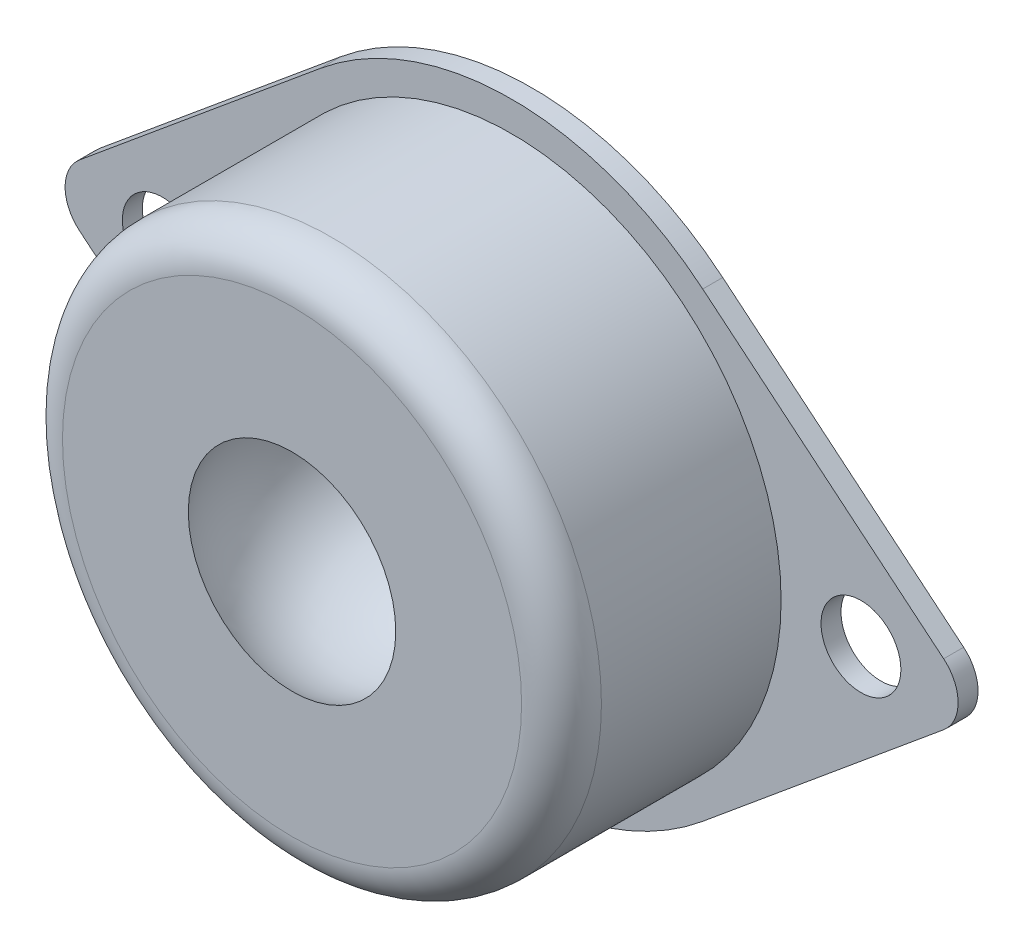
ISO-10303-21;
HEADER;
FILE_DESCRIPTION(('STEP AP214'),'2;1');
FILE_NAME('part.step','',(''),(''),'','','');
FILE_SCHEMA(('AUTOMOTIVE_DESIGN { 1 0 10303 214 1 1 1 1 }'));
ENDSEC;
DATA;
#1=APPLICATION_CONTEXT('core data for automotive mechanical design processes');
#2=APPLICATION_PROTOCOL_DEFINITION('international standard','automotive_design',2000,#1);
#3=PRODUCT_CONTEXT('',#1,'mechanical');
#4=PRODUCT('Part','Part','',(#3));
#5=PRODUCT_RELATED_PRODUCT_CATEGORY('part','',(#4));
#6=PRODUCT_DEFINITION_FORMATION('','',#4);
#7=PRODUCT_DEFINITION_CONTEXT('part definition',#1,'design');
#8=PRODUCT_DEFINITION('design','',#6,#7);
#9=PRODUCT_DEFINITION_SHAPE('','',#8);
#10=(LENGTH_UNIT() NAMED_UNIT(*) SI_UNIT(.MILLI.,.METRE.));
#11=(NAMED_UNIT(*) PLANE_ANGLE_UNIT() SI_UNIT($,.RADIAN.));
#12=(NAMED_UNIT(*) SI_UNIT($,.STERADIAN.) SOLID_ANGLE_UNIT());
#13=UNCERTAINTY_MEASURE_WITH_UNIT(LENGTH_MEASURE(1.E-05),#10,'distance_accuracy_value','');
#14=(GEOMETRIC_REPRESENTATION_CONTEXT(3) GLOBAL_UNCERTAINTY_ASSIGNED_CONTEXT((#13)) GLOBAL_UNIT_ASSIGNED_CONTEXT((#10,
#11,#12)) REPRESENTATION_CONTEXT('',''));
#15=CARTESIAN_POINT('',(0.,0.,0.));
#16=DIRECTION('',(0.,0.,1.));
#17=DIRECTION('',(1.,0.,0.));
#18=AXIS2_PLACEMENT_3D('',#15,#16,#17);
#19=CARTESIAN_POINT('',(-9.57446808510638,-11.5468420309312,1.));
#20=DIRECTION('',(0.638297872340426,0.769789468728746,0.));
#21=DIRECTION('',(-0.769789468728746,0.638297872340426,0.));
#22=AXIS2_PLACEMENT_3D('',#19,#20,#21);
#23=PLANE('',#22);
#24=DIRECTION('',(0.769789468728747,-0.638297872340426,0.));
#25=VECTOR('',#24,1.);
#26=CARTESIAN_POINT('',(-9.57446808510638,-11.5468420309312,0.));
#27=LINE('',#26,#25);
#28=CARTESIAN_POINT('',(-21.6432624113475,-1.53957893745749,0.));
#29=VERTEX_POINT('',#28);
#30=CARTESIAN_POINT('',(-9.57446808510639,-11.5468420309312,0.));
#31=VERTEX_POINT('',#30);
#32=EDGE_CURVE('E142',#29,#31,#27,.T.);
#33=ORIENTED_EDGE('',*,*,#32,.T.);
#34=DIRECTION('',(0.,0.,-1.));
#35=VECTOR('',#34,1.);
#36=CARTESIAN_POINT('',(-9.57446808510639,-11.5468420309312,1.));
#37=LINE('',#36,#35);
#38=CARTESIAN_POINT('',(-9.57446808510639,-11.5468420309312,1.));
#39=VERTEX_POINT('',#38);
#40=EDGE_CURVE('E172',#39,#31,#37,.T.);
#41=ORIENTED_EDGE('',*,*,#40,.F.);
#42=DIRECTION('',(0.769789468728747,-0.638297872340426,0.));
#43=VECTOR('',#42,1.);
#44=CARTESIAN_POINT('',(-9.57446808510638,-11.5468420309312,1.));
#45=LINE('',#44,#43);
#46=CARTESIAN_POINT('',(-21.6432624113475,-1.53957893745749,1.));
#47=VERTEX_POINT('',#46);
#48=EDGE_CURVE('E225',#47,#39,#45,.T.);
#49=ORIENTED_EDGE('',*,*,#48,.F.);
#50=DIRECTION('',(0.,0.,-1.));
#51=VECTOR('',#50,1.);
#52=CARTESIAN_POINT('',(-21.6432624113475,-1.53957893745749,1.));
#53=LINE('',#52,#51);
#54=EDGE_CURVE('E53',#47,#29,#53,.T.);
#55=ORIENTED_EDGE('',*,*,#54,.T.);
#56=EDGE_LOOP('',(#33,#41,#49,#55));
#57=FACE_BOUND('',#56,.T.);
#58=ADVANCED_FACE('F36',(#57),#23,.F.);
#59=CARTESIAN_POINT('',(0.,0.,1.));
#60=DIRECTION('',(0.,0.,-1.));
#61=DIRECTION('',(-1.,0.,0.));
#62=AXIS2_PLACEMENT_3D('',#59,#60,#61);
#63=CYLINDRICAL_SURFACE('',#62,15.);
#64=CARTESIAN_POINT('',(0.,0.,0.));
#65=DIRECTION('',(0.,0.,1.));
#66=DIRECTION('',(1.,0.,0.));
#67=AXIS2_PLACEMENT_3D('',#64,#65,#66);
#68=CIRCLE('',#67,15.);
#69=CARTESIAN_POINT('',(9.57446808510639,-11.5468420309312,0.));
#70=VERTEX_POINT('',#69);
#71=EDGE_CURVE('E144',#31,#70,#68,.T.);
#72=ORIENTED_EDGE('',*,*,#71,.T.);
#73=DIRECTION('',(0.,0.,-1.));
#74=VECTOR('',#73,1.);
#75=CARTESIAN_POINT('',(9.57446808510639,-11.5468420309312,1.));
#76=LINE('',#75,#74);
#77=CARTESIAN_POINT('',(9.57446808510639,-11.5468420309312,1.));
#78=VERTEX_POINT('',#77);
#79=EDGE_CURVE('E170',#78,#70,#76,.T.);
#80=ORIENTED_EDGE('',*,*,#79,.F.);
#81=CARTESIAN_POINT('',(0.,0.,1.));
#82=DIRECTION('',(0.,0.,1.));
#83=DIRECTION('',(1.,0.,0.));
#84=AXIS2_PLACEMENT_3D('',#81,#82,#83);
#85=CIRCLE('',#84,15.);
#86=EDGE_CURVE('E92',#39,#78,#85,.T.);
#87=ORIENTED_EDGE('',*,*,#86,.F.);
#88=ORIENTED_EDGE('',*,*,#40,.T.);
#89=EDGE_LOOP('',(#72,#80,#87,#88));
#90=FACE_BOUND('',#89,.T.);
#91=ADVANCED_FACE('F192',(#90),#63,.T.);
#92=CARTESIAN_POINT('',(9.57446808510639,-11.5468420309312,1.));
#93=DIRECTION('',(0.638297872340426,-0.769789468728746,0.));
#94=DIRECTION('',(0.769789468728746,0.638297872340426,0.));
#95=AXIS2_PLACEMENT_3D('',#92,#93,#94);
#96=PLANE('',#95);
#97=DIRECTION('',(-0.769789468728746,-0.638297872340426,0.));
#98=VECTOR('',#97,1.);
#99=CARTESIAN_POINT('',(9.57446808510639,-11.5468420309312,0.));
#100=LINE('',#99,#98);
#101=CARTESIAN_POINT('',(21.6432624113475,-1.53957893745749,0.));
#102=VERTEX_POINT('',#101);
#103=EDGE_CURVE('E147',#102,#70,#100,.T.);
#104=ORIENTED_EDGE('',*,*,#103,.F.);
#105=DIRECTION('',(0.,0.,-1.));
#106=VECTOR('',#105,1.);
#107=CARTESIAN_POINT('',(21.6432624113475,-1.53957893745749,1.));
#108=LINE('',#107,#106);
#109=CARTESIAN_POINT('',(21.6432624113475,-1.53957893745749,1.));
#110=VERTEX_POINT('',#109);
#111=EDGE_CURVE('E168',#110,#102,#108,.T.);
#112=ORIENTED_EDGE('',*,*,#111,.F.);
#113=DIRECTION('',(-0.769789468728746,-0.638297872340426,0.));
#114=VECTOR('',#113,1.);
#115=CARTESIAN_POINT('',(9.57446808510639,-11.5468420309312,1.));
#116=LINE('',#115,#114);
#117=EDGE_CURVE('E232',#110,#78,#116,.T.);
#118=ORIENTED_EDGE('',*,*,#117,.T.);
#119=ORIENTED_EDGE('',*,*,#79,.T.);
#120=EDGE_LOOP('',(#104,#112,#118,#119));
#121=FACE_BOUND('',#120,.T.);
#122=ADVANCED_FACE('F197',(#121),#96,.T.);
#123=CARTESIAN_POINT('',(20.3666666666667,0.,1.));
#124=DIRECTION('',(0.,0.,-1.));
#125=DIRECTION('',(-1.,0.,0.));
#126=AXIS2_PLACEMENT_3D('',#123,#124,#125);
#127=CYLINDRICAL_SURFACE('',#126,2.);
#128=CARTESIAN_POINT('',(20.3666666666667,0.,0.));
#129=DIRECTION('',(0.,0.,1.));
#130=DIRECTION('',(1.,0.,0.));
#131=AXIS2_PLACEMENT_3D('',#128,#129,#130);
#132=CIRCLE('',#131,2.);
#133=CARTESIAN_POINT('',(21.6432624113475,1.53957893745749,0.));
#134=VERTEX_POINT('',#133);
#135=EDGE_CURVE('E150',#134,#102,#132,.F.);
#136=ORIENTED_EDGE('',*,*,#135,.F.);
#137=DIRECTION('',(0.,0.,-1.));
#138=VECTOR('',#137,1.);
#139=CARTESIAN_POINT('',(21.6432624113475,1.53957893745749,1.));
#140=LINE('',#139,#138);
#141=CARTESIAN_POINT('',(21.6432624113475,1.53957893745749,1.));
#142=VERTEX_POINT('',#141);
#143=EDGE_CURVE('E166',#142,#134,#140,.T.);
#144=ORIENTED_EDGE('',*,*,#143,.F.);
#145=CARTESIAN_POINT('',(20.3666666666667,0.,1.));
#146=DIRECTION('',(0.,0.,1.));
#147=DIRECTION('',(1.,0.,0.));
#148=AXIS2_PLACEMENT_3D('',#145,#146,#147);
#149=CIRCLE('',#148,2.);
#150=EDGE_CURVE('E234',#142,#110,#149,.F.);
#151=ORIENTED_EDGE('',*,*,#150,.T.);
#152=ORIENTED_EDGE('',*,*,#111,.T.);
#153=EDGE_LOOP('',(#136,#144,#151,#152));
#154=FACE_BOUND('',#153,.T.);
#155=ADVANCED_FACE('F268',(#154),#127,.T.);
#156=CARTESIAN_POINT('',(9.57446808510639,11.5468420309312,1.));
#157=DIRECTION('',(-0.638297872340426,-0.769789468728746,0.));
#158=DIRECTION('',(0.769789468728746,-0.638297872340426,0.));
#159=AXIS2_PLACEMENT_3D('',#156,#157,#158);
#160=PLANE('',#159);
#161=DIRECTION('',(-0.769789468728746,0.638297872340426,0.));
#162=VECTOR('',#161,1.);
#163=CARTESIAN_POINT('',(9.57446808510639,11.5468420309312,0.));
#164=LINE('',#163,#162);
#165=CARTESIAN_POINT('',(9.57446808510639,11.5468420309312,0.));
#166=VERTEX_POINT('',#165);
#167=EDGE_CURVE('E153',#134,#166,#164,.T.);
#168=ORIENTED_EDGE('',*,*,#167,.T.);
#169=DIRECTION('',(0.,0.,-1.));
#170=VECTOR('',#169,1.);
#171=CARTESIAN_POINT('',(9.57446808510639,11.5468420309312,1.));
#172=LINE('',#171,#170);
#173=CARTESIAN_POINT('',(9.57446808510639,11.5468420309312,1.));
#174=VERTEX_POINT('',#173);
#175=EDGE_CURVE('E117',#174,#166,#172,.T.);
#176=ORIENTED_EDGE('',*,*,#175,.F.);
#177=DIRECTION('',(-0.769789468728746,0.638297872340426,0.));
#178=VECTOR('',#177,1.);
#179=CARTESIAN_POINT('',(9.57446808510639,11.5468420309312,1.));
#180=LINE('',#179,#178);
#181=EDGE_CURVE('E126',#142,#174,#180,.T.);
#182=ORIENTED_EDGE('',*,*,#181,.F.);
#183=ORIENTED_EDGE('',*,*,#143,.T.);
#184=EDGE_LOOP('',(#168,#176,#182,#183));
#185=FACE_BOUND('',#184,.T.);
#186=ADVANCED_FACE('F265',(#185),#160,.F.);
#187=CARTESIAN_POINT('',(0.,0.,1.));
#188=DIRECTION('',(0.,0.,-1.));
#189=DIRECTION('',(-1.,0.,0.));
#190=AXIS2_PLACEMENT_3D('',#187,#188,#189);
#191=CYLINDRICAL_SURFACE('',#190,15.);
#192=CARTESIAN_POINT('',(0.,0.,0.));
#193=DIRECTION('',(0.,0.,1.));
#194=DIRECTION('',(1.,0.,0.));
#195=AXIS2_PLACEMENT_3D('',#192,#193,#194);
#196=CIRCLE('',#195,15.);
#197=CARTESIAN_POINT('',(-9.57446808510639,11.5468420309312,0.));
#198=VERTEX_POINT('',#197);
#199=EDGE_CURVE('E113',#198,#166,#196,.F.);
#200=ORIENTED_EDGE('',*,*,#199,.F.);
#201=DIRECTION('',(0.,0.,-1.));
#202=VECTOR('',#201,1.);
#203=CARTESIAN_POINT('',(-9.57446808510639,11.5468420309312,1.));
#204=LINE('',#203,#202);
#205=CARTESIAN_POINT('',(-9.57446808510639,11.5468420309312,1.));
#206=VERTEX_POINT('',#205);
#207=EDGE_CURVE('E108',#206,#198,#204,.T.);
#208=ORIENTED_EDGE('',*,*,#207,.F.);
#209=CARTESIAN_POINT('',(0.,0.,1.));
#210=DIRECTION('',(0.,0.,1.));
#211=DIRECTION('',(1.,0.,0.));
#212=AXIS2_PLACEMENT_3D('',#209,#210,#211);
#213=CIRCLE('',#212,15.);
#214=EDGE_CURVE('E111',#206,#174,#213,.F.);
#215=ORIENTED_EDGE('',*,*,#214,.T.);
#216=ORIENTED_EDGE('',*,*,#175,.T.);
#217=EDGE_LOOP('',(#200,#208,#215,#216));
#218=FACE_BOUND('',#217,.T.);
#219=ADVANCED_FACE('F110',(#218),#191,.T.);
#220=CARTESIAN_POINT('',(-9.57446808510638,11.5468420309312,1.));
#221=DIRECTION('',(-0.638297872340426,0.769789468728746,0.));
#222=DIRECTION('',(-0.769789468728746,-0.638297872340426,0.));
#223=AXIS2_PLACEMENT_3D('',#220,#221,#222);
#224=PLANE('',#223);
#225=DIRECTION('',(0.769789468728747,0.638297872340426,0.));
#226=VECTOR('',#225,1.);
#227=CARTESIAN_POINT('',(-9.57446808510638,11.5468420309312,0.));
#228=LINE('',#227,#226);
#229=CARTESIAN_POINT('',(-21.6432624113475,1.53957893745749,0.));
#230=VERTEX_POINT('',#229);
#231=EDGE_CURVE('E157',#230,#198,#228,.T.);
#232=ORIENTED_EDGE('',*,*,#231,.F.);
#233=DIRECTION('',(0.,0.,-1.));
#234=VECTOR('',#233,1.);
#235=CARTESIAN_POINT('',(-21.6432624113475,1.53957893745749,1.));
#236=LINE('',#235,#234);
#237=CARTESIAN_POINT('',(-21.6432624113475,1.53957893745749,1.));
#238=VERTEX_POINT('',#237);
#239=EDGE_CURVE('E79',#238,#230,#236,.T.);
#240=ORIENTED_EDGE('',*,*,#239,.F.);
#241=DIRECTION('',(0.769789468728747,0.638297872340426,0.));
#242=VECTOR('',#241,1.);
#243=CARTESIAN_POINT('',(-9.57446808510638,11.5468420309312,1.));
#244=LINE('',#243,#242);
#245=EDGE_CURVE('E123',#238,#206,#244,.T.);
#246=ORIENTED_EDGE('',*,*,#245,.T.);
#247=ORIENTED_EDGE('',*,*,#207,.T.);
#248=EDGE_LOOP('',(#232,#240,#246,#247));
#249=FACE_BOUND('',#248,.T.);
#250=ADVANCED_FACE('F129',(#249),#224,.T.);
#251=CARTESIAN_POINT('',(17.5,0.,1.));
#252=DIRECTION('',(0.,0.,-1.));
#253=DIRECTION('',(-1.,0.,0.));
#254=AXIS2_PLACEMENT_3D('',#251,#252,#253);
#255=CYLINDRICAL_SURFACE('',#254,2.);
#256=CARTESIAN_POINT('',(17.5,0.,1.));
#257=DIRECTION('',(0.,0.,1.));
#258=DIRECTION('',(1.,0.,0.));
#259=AXIS2_PLACEMENT_3D('',#256,#257,#258);
#260=CIRCLE('',#259,2.);
#261=CARTESIAN_POINT('',(19.5,0.,1.));
#262=VERTEX_POINT('',#261);
#263=EDGE_CURVE('E240',#262,#262,#260,.T.);
#264=ORIENTED_EDGE('',*,*,#263,.T.);
#265=EDGE_LOOP('',(#264));
#266=FACE_BOUND('',#265,.T.);
#267=CARTESIAN_POINT('',(17.5,0.,0.));
#268=DIRECTION('',(0.,0.,1.));
#269=DIRECTION('',(1.,0.,0.));
#270=AXIS2_PLACEMENT_3D('',#267,#268,#269);
#271=CIRCLE('',#270,2.);
#272=CARTESIAN_POINT('',(19.5,0.,0.));
#273=VERTEX_POINT('',#272);
#274=EDGE_CURVE('E138',#273,#273,#271,.T.);
#275=ORIENTED_EDGE('',*,*,#274,.F.);
#276=EDGE_LOOP('',(#275));
#277=FACE_BOUND('',#276,.T.);
#278=ADVANCED_FACE('F201',(#266,#277),#255,.F.);
#279=CARTESIAN_POINT('',(-17.5,0.,1.));
#280=DIRECTION('',(0.,0.,-1.));
#281=DIRECTION('',(-1.,0.,0.));
#282=AXIS2_PLACEMENT_3D('',#279,#280,#281);
#283=CYLINDRICAL_SURFACE('',#282,2.);
#284=CARTESIAN_POINT('',(-17.5,0.,1.));
#285=DIRECTION('',(0.,0.,1.));
#286=DIRECTION('',(1.,0.,0.));
#287=AXIS2_PLACEMENT_3D('',#284,#285,#286);
#288=CIRCLE('',#287,2.);
#289=CARTESIAN_POINT('',(-15.5,0.,1.));
#290=VERTEX_POINT('',#289);
#291=EDGE_CURVE('E215',#290,#290,#288,.T.);
#292=ORIENTED_EDGE('',*,*,#291,.T.);
#293=EDGE_LOOP('',(#292));
#294=FACE_BOUND('',#293,.T.);
#295=CARTESIAN_POINT('',(-17.5,0.,0.));
#296=DIRECTION('',(0.,0.,1.));
#297=DIRECTION('',(1.,0.,0.));
#298=AXIS2_PLACEMENT_3D('',#295,#296,#297);
#299=CIRCLE('',#298,2.);
#300=CARTESIAN_POINT('',(-15.5,0.,0.));
#301=VERTEX_POINT('',#300);
#302=EDGE_CURVE('E135',#301,#301,#299,.T.);
#303=ORIENTED_EDGE('',*,*,#302,.F.);
#304=EDGE_LOOP('',(#303));
#305=FACE_BOUND('',#304,.T.);
#306=ADVANCED_FACE('F203',(#294,#305),#283,.F.);
#307=CARTESIAN_POINT('',(-20.3666666666667,0.,1.));
#308=DIRECTION('',(0.,0.,-1.));
#309=DIRECTION('',(-1.,0.,0.));
#310=AXIS2_PLACEMENT_3D('',#307,#308,#309);
#311=CYLINDRICAL_SURFACE('',#310,2.);
#312=CARTESIAN_POINT('',(-20.3666666666667,0.,0.));
#313=DIRECTION('',(0.,0.,1.));
#314=DIRECTION('',(1.,0.,0.));
#315=AXIS2_PLACEMENT_3D('',#312,#313,#314);
#316=CIRCLE('',#315,2.);
#317=EDGE_CURVE('E159',#29,#230,#316,.F.);
#318=ORIENTED_EDGE('',*,*,#317,.F.);
#319=ORIENTED_EDGE('',*,*,#54,.F.);
#320=CARTESIAN_POINT('',(-20.3666666666667,0.,1.));
#321=DIRECTION('',(0.,0.,1.));
#322=DIRECTION('',(1.,0.,0.));
#323=AXIS2_PLACEMENT_3D('',#320,#321,#322);
#324=CIRCLE('',#323,2.);
#325=EDGE_CURVE('E130',#47,#238,#324,.F.);
#326=ORIENTED_EDGE('',*,*,#325,.T.);
#327=ORIENTED_EDGE('',*,*,#239,.T.);
#328=EDGE_LOOP('',(#318,#319,#326,#327));
#329=FACE_BOUND('',#328,.T.);
#330=ADVANCED_FACE('F206',(#329),#311,.T.);
#331=CARTESIAN_POINT('',(0.,0.,1.));
#332=DIRECTION('',(0.,0.,1.));
#333=DIRECTION('',(1.,0.,0.));
#334=AXIS2_PLACEMENT_3D('',#331,#332,#333);
#335=PLANE('',#334);
#336=CARTESIAN_POINT('',(0.,0.,1.));
#337=DIRECTION('',(0.,0.,1.));
#338=DIRECTION('',(1.,0.,0.));
#339=AXIS2_PLACEMENT_3D('',#336,#337,#338);
#340=CIRCLE('',#339,13.5);
#341=CARTESIAN_POINT('',(13.5,0.,1.));
#342=VERTEX_POINT('',#341);
#343=EDGE_CURVE('E162',#342,#342,#340,.T.);
#344=ORIENTED_EDGE('',*,*,#343,.F.);
#345=EDGE_LOOP('',(#344));
#346=FACE_BOUND('',#345,.T.);
#347=ORIENTED_EDGE('',*,*,#291,.F.);
#348=EDGE_LOOP('',(#347));
#349=FACE_BOUND('',#348,.T.);
#350=ORIENTED_EDGE('',*,*,#263,.F.);
#351=EDGE_LOOP('',(#350));
#352=FACE_BOUND('',#351,.T.);
#353=ORIENTED_EDGE('',*,*,#48,.T.);
#354=ORIENTED_EDGE('',*,*,#86,.T.);
#355=ORIENTED_EDGE('',*,*,#117,.F.);
#356=ORIENTED_EDGE('',*,*,#150,.F.);
#357=ORIENTED_EDGE('',*,*,#181,.T.);
#358=ORIENTED_EDGE('',*,*,#214,.F.);
#359=ORIENTED_EDGE('',*,*,#245,.F.);
#360=ORIENTED_EDGE('',*,*,#325,.F.);
#361=EDGE_LOOP('',(#353,#354,#355,#356,#357,#358,#359,#360));
#362=FACE_BOUND('',#361,.T.);
#363=ADVANCED_FACE('F121',(#346,#349,#352,#362),#335,.T.);
#364=CARTESIAN_POINT('',(0.,0.,0.));
#365=DIRECTION('',(0.,0.,1.));
#366=DIRECTION('',(1.,0.,0.));
#367=AXIS2_PLACEMENT_3D('',#364,#365,#366);
#368=PLANE('',#367);
#369=ORIENTED_EDGE('',*,*,#302,.T.);
#370=EDGE_LOOP('',(#369));
#371=FACE_BOUND('',#370,.T.);
#372=ORIENTED_EDGE('',*,*,#274,.T.);
#373=EDGE_LOOP('',(#372));
#374=FACE_BOUND('',#373,.T.);
#375=ORIENTED_EDGE('',*,*,#32,.F.);
#376=ORIENTED_EDGE('',*,*,#317,.T.);
#377=ORIENTED_EDGE('',*,*,#231,.T.);
#378=ORIENTED_EDGE('',*,*,#199,.T.);
#379=ORIENTED_EDGE('',*,*,#167,.F.);
#380=ORIENTED_EDGE('',*,*,#135,.T.);
#381=ORIENTED_EDGE('',*,*,#103,.T.);
#382=ORIENTED_EDGE('',*,*,#71,.F.);
#383=EDGE_LOOP('',(#375,#376,#377,#378,#379,#380,#381,#382));
#384=FACE_BOUND('',#383,.T.);
#385=ADVANCED_FACE('F218',(#371,#374,#384),#368,.F.);
#386=CARTESIAN_POINT('',(0.,0.,12.));
#387=DIRECTION('',(0.,0.,-1.));
#388=DIRECTION('',(-1.,0.,0.));
#389=AXIS2_PLACEMENT_3D('',#386,#387,#388);
#390=CYLINDRICAL_SURFACE('',#389,13.5);
#391=CARTESIAN_POINT('',(0.,0.,10.));
#392=DIRECTION('',(0.,0.,1.));
#393=DIRECTION('',(1.,0.,0.));
#394=AXIS2_PLACEMENT_3D('',#391,#392,#393);
#395=CIRCLE('',#394,13.5);
#396=CARTESIAN_POINT('',(13.5,0.,10.));
#397=VERTEX_POINT('',#396);
#398=EDGE_CURVE('E11',#397,#397,#395,.F.);
#399=ORIENTED_EDGE('',*,*,#398,.T.);
#400=EDGE_LOOP('',(#399));
#401=FACE_BOUND('',#400,.T.);
#402=ORIENTED_EDGE('',*,*,#343,.T.);
#403=EDGE_LOOP('',(#402));
#404=FACE_BOUND('',#403,.T.);
#405=ADVANCED_FACE('F187',(#401,#404),#390,.T.);
#406=CARTESIAN_POINT('',(0.,0.,12.));
#407=DIRECTION('',(0.,0.,1.));
#408=DIRECTION('',(1.,0.,0.));
#409=AXIS2_PLACEMENT_3D('',#406,#407,#408);
#410=PLANE('',#409);
#411=CARTESIAN_POINT('',(0.,0.,12.));
#412=DIRECTION('',(0.,0.,-1.));
#413=DIRECTION('',(-1.,0.,0.));
#414=AXIS2_PLACEMENT_3D('',#411,#412,#413);
#415=CIRCLE('',#414,5.19615242270663);
#416=CARTESIAN_POINT('',(-5.19615242270663,0.,12.));
#417=VERTEX_POINT('',#416);
#418=EDGE_CURVE('E139',#417,#417,#415,.T.);
#419=ORIENTED_EDGE('',*,*,#418,.T.);
#420=EDGE_LOOP('',(#419));
#421=FACE_BOUND('',#420,.T.);
#422=CARTESIAN_POINT('',(0.,0.,12.));
#423=DIRECTION('',(0.,0.,1.));
#424=DIRECTION('',(1.,0.,0.));
#425=AXIS2_PLACEMENT_3D('',#422,#423,#424);
#426=CIRCLE('',#425,11.5);
#427=CARTESIAN_POINT('',(11.5,0.,12.));
#428=VERTEX_POINT('',#427);
#429=EDGE_CURVE('E45',#428,#428,#426,.T.);
#430=ORIENTED_EDGE('',*,*,#429,.T.);
#431=EDGE_LOOP('',(#430));
#432=FACE_BOUND('',#431,.T.);
#433=ADVANCED_FACE('F176',(#421,#432),#410,.T.);
#434=CARTESIAN_POINT('',(0.,0.,10.));
#435=DIRECTION('',(0.,0.,1.));
#436=DIRECTION('',(1.,0.,0.));
#437=AXIS2_PLACEMENT_3D('',#434,#435,#436);
#438=TOROIDAL_SURFACE('',#437,11.5,2.);
#439=ORIENTED_EDGE('',*,*,#398,.F.);
#440=EDGE_LOOP('',(#439));
#441=FACE_BOUND('',#440,.T.);
#442=ORIENTED_EDGE('',*,*,#429,.F.);
#443=EDGE_LOOP('',(#442));
#444=FACE_BOUND('',#443,.T.);
#445=ADVANCED_FACE('F38',(#441,#444),#438,.T.);
#446=CARTESIAN_POINT('',(0.,0.,9.));
#447=DIRECTION('',(0.,0.,-1.));
#448=DIRECTION('',(1.,0.,0.));
#449=AXIS2_PLACEMENT_3D('',#446,#447,#448);
#450=SPHERICAL_SURFACE('',#449,6.00000000000001);
#451=ORIENTED_EDGE('',*,*,#418,.F.);
#452=EDGE_LOOP('',(#451));
#453=FACE_BOUND('',#452,.T.);
#454=ADVANCED_FACE('F179',(#453),#450,.F.);
#455=CLOSED_SHELL('',(#58,#91,#122,#155,#186,#219,#250,#278,#306,#330,#363,#385,#405,#433,#445,#454));
#456=MANIFOLD_SOLID_BREP('B2',#455);
#457=ADVANCED_BREP_SHAPE_REPRESENTATION('',(#18,#456),#14);
#458=SHAPE_DEFINITION_REPRESENTATION(#9,#457);
ENDSEC;
END-ISO-10303-21;
